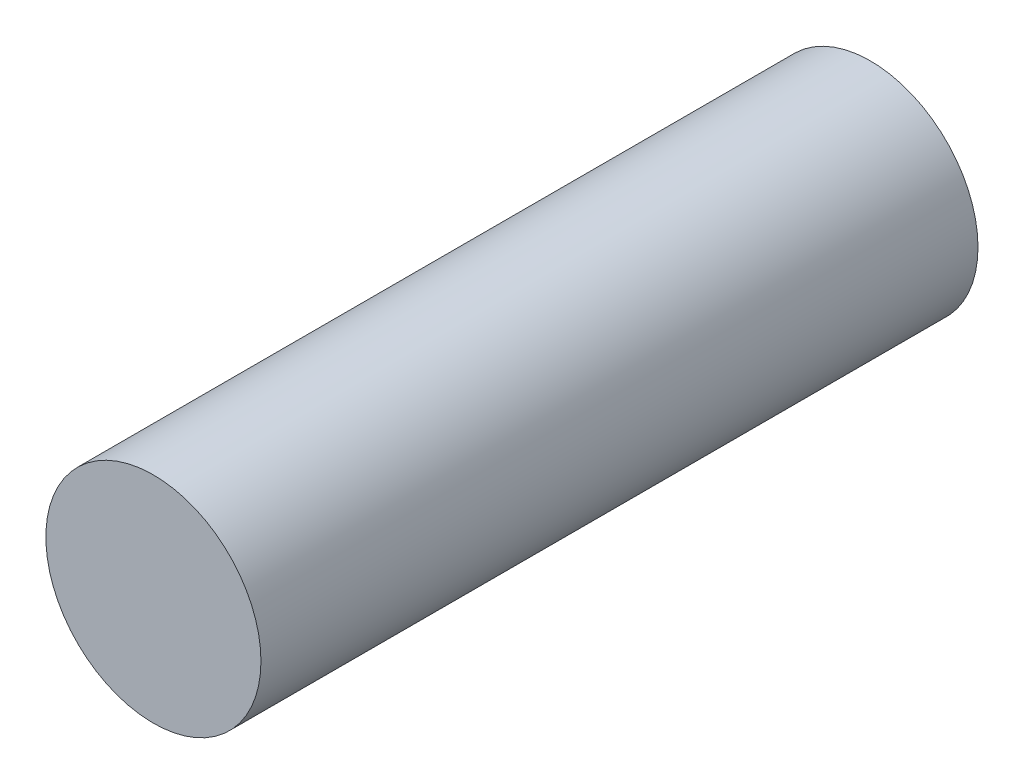
ISO-10303-21;
HEADER;
FILE_DESCRIPTION(('STEP AP214'),'2;1');
FILE_NAME('part.step','',(''),(''),'','','');
FILE_SCHEMA(('AUTOMOTIVE_DESIGN { 1 0 10303 214 1 1 1 1 }'));
ENDSEC;
DATA;
#1=APPLICATION_CONTEXT('core data for automotive mechanical design processes');
#2=APPLICATION_PROTOCOL_DEFINITION('international standard','automotive_design',2000,#1);
#3=PRODUCT_CONTEXT('',#1,'mechanical');
#4=PRODUCT('Part','Part','',(#3));
#5=PRODUCT_RELATED_PRODUCT_CATEGORY('part','',(#4));
#6=PRODUCT_DEFINITION_FORMATION('','',#4);
#7=PRODUCT_DEFINITION_CONTEXT('part definition',#1,'design');
#8=PRODUCT_DEFINITION('design','',#6,#7);
#9=PRODUCT_DEFINITION_SHAPE('','',#8);
#10=(LENGTH_UNIT() NAMED_UNIT(*) SI_UNIT(.MILLI.,.METRE.));
#11=(NAMED_UNIT(*) PLANE_ANGLE_UNIT() SI_UNIT($,.RADIAN.));
#12=(NAMED_UNIT(*) SI_UNIT($,.STERADIAN.) SOLID_ANGLE_UNIT());
#13=UNCERTAINTY_MEASURE_WITH_UNIT(LENGTH_MEASURE(1.E-05),#10,'distance_accuracy_value','');
#14=(GEOMETRIC_REPRESENTATION_CONTEXT(3) GLOBAL_UNCERTAINTY_ASSIGNED_CONTEXT((#13)) GLOBAL_UNIT_ASSIGNED_CONTEXT((#10,
#11,#12)) REPRESENTATION_CONTEXT('',''));
#15=CARTESIAN_POINT('',(0.,0.,0.));
#16=DIRECTION('',(0.,0.,1.));
#17=DIRECTION('',(1.,0.,0.));
#18=AXIS2_PLACEMENT_3D('',#15,#16,#17);
#19=CARTESIAN_POINT('',(0.,0.,280.));
#20=DIRECTION('',(0.,0.,-1.));
#21=DIRECTION('',(-1.,0.,0.));
#22=AXIS2_PLACEMENT_3D('',#19,#20,#21);
#23=CYLINDRICAL_SURFACE('',#22,42.);
#24=CARTESIAN_POINT('',(0.,0.,280.));
#25=DIRECTION('',(0.,0.,1.));
#26=DIRECTION('',(1.,0.,0.));
#27=AXIS2_PLACEMENT_3D('',#24,#25,#26);
#28=CIRCLE('',#27,42.);
#29=CARTESIAN_POINT('',(42.,0.,280.));
#30=VERTEX_POINT('',#29);
#31=EDGE_CURVE('E10',#30,#30,#28,.T.);
#32=ORIENTED_EDGE('',*,*,#31,.F.);
#33=EDGE_LOOP('',(#32));
#34=FACE_BOUND('',#33,.T.);
#35=CARTESIAN_POINT('',(0.,0.,0.));
#36=DIRECTION('',(0.,0.,1.));
#37=DIRECTION('',(1.,0.,0.));
#38=AXIS2_PLACEMENT_3D('',#35,#36,#37);
#39=CIRCLE('',#38,42.);
#40=CARTESIAN_POINT('',(42.,0.,0.));
#41=VERTEX_POINT('',#40);
#42=EDGE_CURVE('E36',#41,#41,#39,.T.);
#43=ORIENTED_EDGE('',*,*,#42,.T.);
#44=EDGE_LOOP('',(#43));
#45=FACE_BOUND('',#44,.T.);
#46=ADVANCED_FACE('F33',(#34,#45),#23,.T.);
#47=CARTESIAN_POINT('',(0.,0.,280.));
#48=DIRECTION('',(0.,0.,1.));
#49=DIRECTION('',(1.,0.,0.));
#50=AXIS2_PLACEMENT_3D('',#47,#48,#49);
#51=PLANE('',#50);
#52=ORIENTED_EDGE('',*,*,#31,.T.);
#53=EDGE_LOOP('',(#52));
#54=FACE_BOUND('',#53,.T.);
#55=ADVANCED_FACE('F48',(#54),#51,.T.);
#56=CARTESIAN_POINT('',(0.,0.,0.));
#57=DIRECTION('',(0.,0.,1.));
#58=DIRECTION('',(1.,0.,0.));
#59=AXIS2_PLACEMENT_3D('',#56,#57,#58);
#60=PLANE('',#59);
#61=ORIENTED_EDGE('',*,*,#42,.F.);
#62=EDGE_LOOP('',(#61));
#63=FACE_BOUND('',#62,.T.);
#64=ADVANCED_FACE('F46',(#63),#60,.F.);
#65=CLOSED_SHELL('',(#46,#55,#64));
#66=MANIFOLD_SOLID_BREP('B2',#65);
#67=ADVANCED_BREP_SHAPE_REPRESENTATION('',(#18,#66),#14);
#68=SHAPE_DEFINITION_REPRESENTATION(#9,#67);
ENDSEC;
END-ISO-10303-21;
